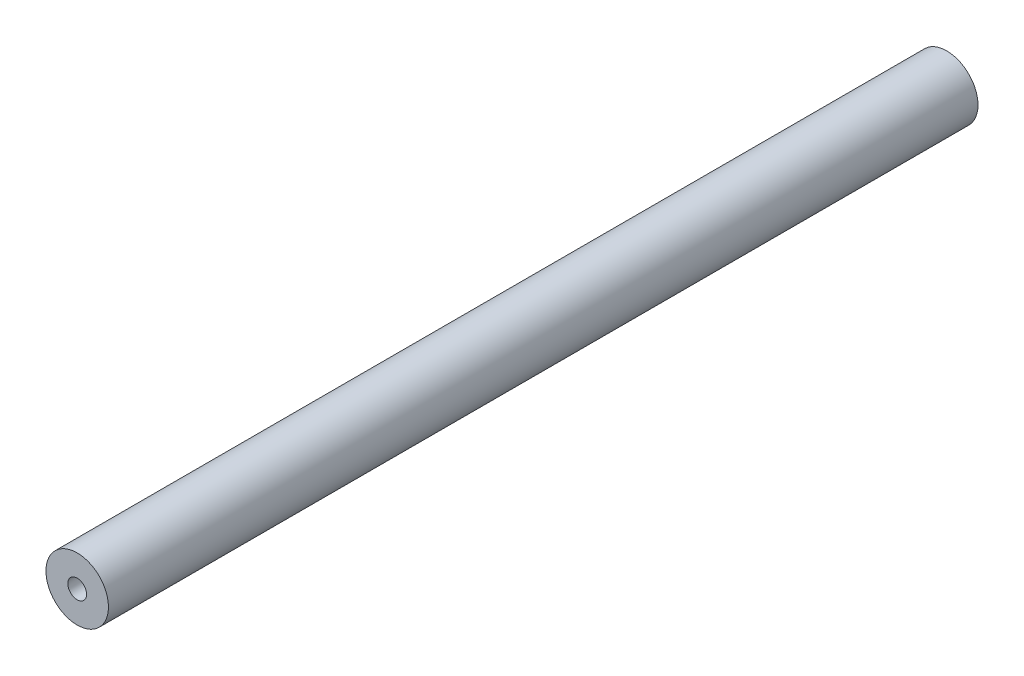
ISO-10303-21;
HEADER;
FILE_DESCRIPTION(('STEP AP214'),'2;1');
FILE_NAME('part.step','',(''),(''),'','','');
FILE_SCHEMA(('AUTOMOTIVE_DESIGN { 1 0 10303 214 1 1 1 1 }'));
ENDSEC;
DATA;
#1=APPLICATION_CONTEXT('core data for automotive mechanical design processes');
#2=APPLICATION_PROTOCOL_DEFINITION('international standard','automotive_design',2000,#1);
#3=PRODUCT_CONTEXT('',#1,'mechanical');
#4=PRODUCT('Part','Part','',(#3));
#5=PRODUCT_RELATED_PRODUCT_CATEGORY('part','',(#4));
#6=PRODUCT_DEFINITION_FORMATION('','',#4);
#7=PRODUCT_DEFINITION_CONTEXT('part definition',#1,'design');
#8=PRODUCT_DEFINITION('design','',#6,#7);
#9=PRODUCT_DEFINITION_SHAPE('','',#8);
#10=(LENGTH_UNIT() NAMED_UNIT(*) SI_UNIT(.MILLI.,.METRE.));
#11=(NAMED_UNIT(*) PLANE_ANGLE_UNIT() SI_UNIT($,.RADIAN.));
#12=(NAMED_UNIT(*) SI_UNIT($,.STERADIAN.) SOLID_ANGLE_UNIT());
#13=UNCERTAINTY_MEASURE_WITH_UNIT(LENGTH_MEASURE(1.E-05),#10,'distance_accuracy_value','');
#14=(GEOMETRIC_REPRESENTATION_CONTEXT(3) GLOBAL_UNCERTAINTY_ASSIGNED_CONTEXT((#13)) GLOBAL_UNIT_ASSIGNED_CONTEXT((#10,
#11,#12)) REPRESENTATION_CONTEXT('',''));
#15=CARTESIAN_POINT('',(0.,0.,0.));
#16=DIRECTION('',(0.,0.,1.));
#17=DIRECTION('',(1.,0.,0.));
#18=AXIS2_PLACEMENT_3D('',#15,#16,#17);
#19=CARTESIAN_POINT('',(0.,0.,883.412));
#20=DIRECTION('',(0.,0.,1.));
#21=DIRECTION('',(1.,0.,0.));
#22=AXIS2_PLACEMENT_3D('',#19,#20,#21);
#23=PLANE('',#22);
#24=CARTESIAN_POINT('',(0.,0.,883.412));
#25=DIRECTION('',(0.,0.,1.));
#26=DIRECTION('',(1.,0.,0.));
#27=AXIS2_PLACEMENT_3D('',#24,#25,#26);
#28=CIRCLE('',#27,31.75);
#29=CARTESIAN_POINT('',(31.75,0.,883.412));
#30=VERTEX_POINT('',#29);
#31=EDGE_CURVE('E10',#30,#30,#28,.T.);
#32=ORIENTED_EDGE('',*,*,#31,.T.);
#33=EDGE_LOOP('',(#32));
#34=FACE_BOUND('',#33,.T.);
#35=CARTESIAN_POINT('',(0.,0.,883.412));
#36=DIRECTION('',(0.,0.,1.));
#37=DIRECTION('',(1.,0.,0.));
#38=AXIS2_PLACEMENT_3D('',#35,#36,#37);
#39=CIRCLE('',#38,9.525);
#40=CARTESIAN_POINT('',(9.525,0.,883.412));
#41=VERTEX_POINT('',#40);
#42=EDGE_CURVE('E42',#41,#41,#39,.T.);
#43=ORIENTED_EDGE('',*,*,#42,.F.);
#44=EDGE_LOOP('',(#43));
#45=FACE_BOUND('',#44,.T.);
#46=ADVANCED_FACE('F31',(#34,#45),#23,.T.);
#47=CARTESIAN_POINT('',(0.,0.,0.));
#48=DIRECTION('',(0.,0.,1.));
#49=DIRECTION('',(1.,0.,0.));
#50=AXIS2_PLACEMENT_3D('',#47,#48,#49);
#51=PLANE('',#50);
#52=CARTESIAN_POINT('',(0.,0.,0.));
#53=DIRECTION('',(0.,0.,1.));
#54=DIRECTION('',(1.,0.,0.));
#55=AXIS2_PLACEMENT_3D('',#52,#53,#54);
#56=CIRCLE('',#55,31.75);
#57=CARTESIAN_POINT('',(31.75,0.,0.));
#58=VERTEX_POINT('',#57);
#59=EDGE_CURVE('E35',#58,#58,#56,.T.);
#60=ORIENTED_EDGE('',*,*,#59,.F.);
#61=EDGE_LOOP('',(#60));
#62=FACE_BOUND('',#61,.T.);
#63=CARTESIAN_POINT('',(0.,0.,0.));
#64=DIRECTION('',(0.,0.,1.));
#65=DIRECTION('',(1.,0.,0.));
#66=AXIS2_PLACEMENT_3D('',#63,#64,#65);
#67=CIRCLE('',#66,9.525);
#68=CARTESIAN_POINT('',(9.525,0.,0.));
#69=VERTEX_POINT('',#68);
#70=EDGE_CURVE('E44',#69,#69,#67,.T.);
#71=ORIENTED_EDGE('',*,*,#70,.T.);
#72=EDGE_LOOP('',(#71));
#73=FACE_BOUND('',#72,.T.);
#74=ADVANCED_FACE('F54',(#62,#73),#51,.F.);
#75=CARTESIAN_POINT('',(0.,0.,883.412));
#76=DIRECTION('',(0.,0.,-1.));
#77=DIRECTION('',(-1.,0.,0.));
#78=AXIS2_PLACEMENT_3D('',#75,#76,#77);
#79=CYLINDRICAL_SURFACE('',#78,31.75);
#80=ORIENTED_EDGE('',*,*,#31,.F.);
#81=EDGE_LOOP('',(#80));
#82=FACE_BOUND('',#81,.T.);
#83=ORIENTED_EDGE('',*,*,#59,.T.);
#84=EDGE_LOOP('',(#83));
#85=FACE_BOUND('',#84,.T.);
#86=ADVANCED_FACE('F33',(#82,#85),#79,.T.);
#87=CARTESIAN_POINT('',(0.,0.,883.412));
#88=DIRECTION('',(0.,0.,-1.));
#89=DIRECTION('',(-1.,0.,0.));
#90=AXIS2_PLACEMENT_3D('',#87,#88,#89);
#91=CYLINDRICAL_SURFACE('',#90,9.525);
#92=ORIENTED_EDGE('',*,*,#42,.T.);
#93=EDGE_LOOP('',(#92));
#94=FACE_BOUND('',#93,.T.);
#95=ORIENTED_EDGE('',*,*,#70,.F.);
#96=EDGE_LOOP('',(#95));
#97=FACE_BOUND('',#96,.T.);
#98=ADVANCED_FACE('F50',(#94,#97),#91,.F.);
#99=CLOSED_SHELL('',(#46,#74,#86,#98));
#100=MANIFOLD_SOLID_BREP('B2',#99);
#101=ADVANCED_BREP_SHAPE_REPRESENTATION('',(#18,#100),#14);
#102=SHAPE_DEFINITION_REPRESENTATION(#9,#101);
ENDSEC;
END-ISO-10303-21;
